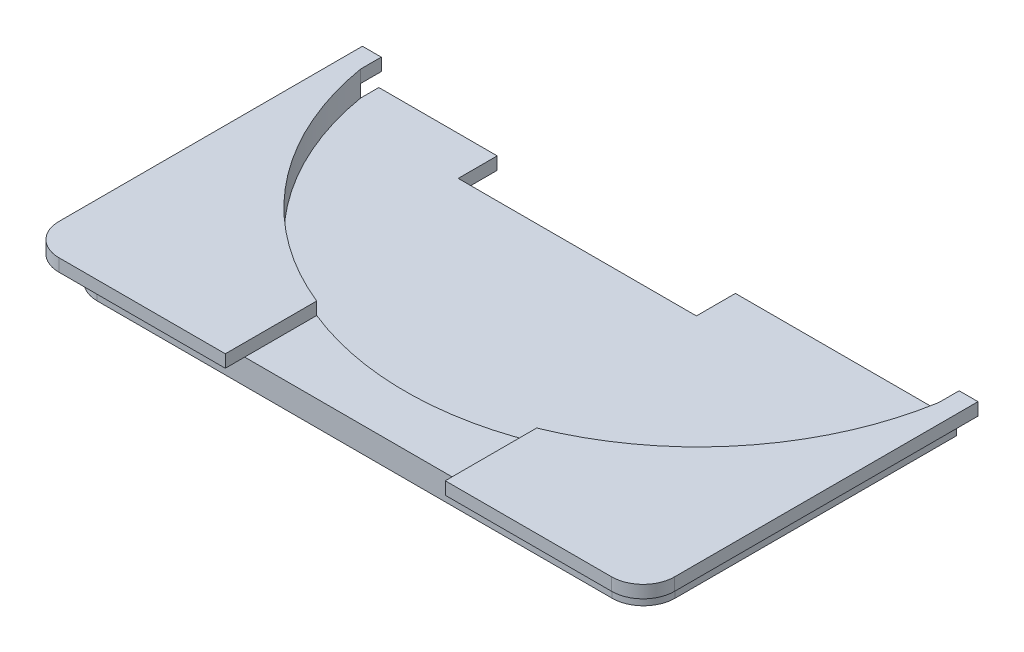
ISO-10303-21;
HEADER;
FILE_DESCRIPTION(('STEP AP214'),'2;1');
FILE_NAME('part.step','',(''),(''),'','','');
FILE_SCHEMA(('AUTOMOTIVE_DESIGN { 1 0 10303 214 1 1 1 1 }'));
ENDSEC;
DATA;
#1=APPLICATION_CONTEXT('core data for automotive mechanical design processes');
#2=APPLICATION_PROTOCOL_DEFINITION('international standard','automotive_design',2000,#1);
#3=PRODUCT_CONTEXT('',#1,'mechanical');
#4=PRODUCT('Part','Part','',(#3));
#5=PRODUCT_RELATED_PRODUCT_CATEGORY('part','',(#4));
#6=PRODUCT_DEFINITION_FORMATION('','',#4);
#7=PRODUCT_DEFINITION_CONTEXT('part definition',#1,'design');
#8=PRODUCT_DEFINITION('design','',#6,#7);
#9=PRODUCT_DEFINITION_SHAPE('','',#8);
#10=(LENGTH_UNIT() NAMED_UNIT(*) SI_UNIT(.MILLI.,.METRE.));
#11=(NAMED_UNIT(*) PLANE_ANGLE_UNIT() SI_UNIT($,.RADIAN.));
#12=(NAMED_UNIT(*) SI_UNIT($,.STERADIAN.) SOLID_ANGLE_UNIT());
#13=UNCERTAINTY_MEASURE_WITH_UNIT(LENGTH_MEASURE(1.E-05),#10,'distance_accuracy_value','');
#14=(GEOMETRIC_REPRESENTATION_CONTEXT(3) GLOBAL_UNCERTAINTY_ASSIGNED_CONTEXT((#13)) GLOBAL_UNIT_ASSIGNED_CONTEXT((#10,
#11,#12)) REPRESENTATION_CONTEXT('',''));
#15=CARTESIAN_POINT('',(0.,0.,0.));
#16=DIRECTION('',(0.,0.,1.));
#17=DIRECTION('',(1.,0.,0.));
#18=AXIS2_PLACEMENT_3D('',#15,#16,#17);
#19=CARTESIAN_POINT('',(-102.035735829472,4.,45.8580425502869));
#20=DIRECTION('',(0.,1.,0.));
#21=DIRECTION('',(0.,0.,1.));
#22=AXIS2_PLACEMENT_3D('',#19,#20,#21);
#23=PLANE('',#22);
#24=DIRECTION('',(1.,0.,0.));
#25=VECTOR('',#24,1.);
#26=CARTESIAN_POINT('',(-102.035735829472,4.,50.8580425502869));
#27=LINE('',#26,#25);
#28=CARTESIAN_POINT('',(-78.5477078121989,4.,50.8580425502869));
#29=VERTEX_POINT('',#28);
#30=CARTESIAN_POINT('',(-43.5307751661155,4.,50.8580425502869));
#31=VERTEX_POINT('',#30);
#32=EDGE_CURVE('E343',#29,#31,#27,.T.);
#33=ORIENTED_EDGE('',*,*,#32,.T.);
#34=DIRECTION('',(0.,0.,1.));
#35=VECTOR('',#34,1.);
#36=CARTESIAN_POINT('',(-43.5307751661155,4.,53.9393128759553));
#37=LINE('',#36,#35);
#38=CARTESIAN_POINT('',(-43.5307751661155,4.,39.3922849965716));
#39=VERTEX_POINT('',#38);
#40=EDGE_CURVE('E701',#39,#31,#37,.T.);
#41=ORIENTED_EDGE('',*,*,#40,.F.);
#42=CARTESIAN_POINT('',(-61.0392414891572,4.,-3.84195744971311));
#43=DIRECTION('',(0.,1.,0.));
#44=DIRECTION('',(0.,0.,1.));
#45=AXIS2_PLACEMENT_3D('',#42,#43,#44);
#46=CIRCLE('',#45,46.6448937493614);
#47=CARTESIAN_POINT('',(-78.5477078121989,4.,39.3922849965716));
#48=VERTEX_POINT('',#47);
#49=EDGE_CURVE('E319',#48,#39,#46,.T.);
#50=ORIENTED_EDGE('',*,*,#49,.F.);
#51=DIRECTION('',(0.,0.,-1.));
#52=VECTOR('',#51,1.);
#53=CARTESIAN_POINT('',(-78.5477078121989,4.,53.9393128759553));
#54=LINE('',#53,#52);
#55=EDGE_CURVE('E11',#29,#48,#54,.T.);
#56=ORIENTED_EDGE('',*,*,#55,.F.);
#57=EDGE_LOOP('',(#33,#41,#50,#56));
#58=FACE_BOUND('',#57,.T.);
#59=ADVANCED_FACE('F33',(#58),#23,.T.);
#60=CARTESIAN_POINT('',(-102.035735829472,0.,45.8580425502869));
#61=DIRECTION('',(0.,1.,0.));
#62=DIRECTION('',(0.,0.,1.));
#63=AXIS2_PLACEMENT_3D('',#60,#61,#62);
#64=PLANE('',#63);
#65=DIRECTION('',(0.,0.,1.));
#66=VECTOR('',#65,1.);
#67=CARTESIAN_POINT('',(-107.035735829472,0.,-49.1419574497131));
#68=LINE('',#67,#66);
#69=CARTESIAN_POINT('',(-107.035735829472,0.,1.01136300629423));
#70=VERTEX_POINT('',#69);
#71=CARTESIAN_POINT('',(-107.035735829472,0.,45.8580425502868));
#72=VERTEX_POINT('',#71);
#73=EDGE_CURVE('E335',#70,#72,#68,.T.);
#74=ORIENTED_EDGE('',*,*,#73,.F.);
#75=DIRECTION('',(1.,0.,0.));
#76=VECTOR('',#75,1.);
#77=CARTESIAN_POINT('',(-102.035735829472,0.,1.01136300629422));
#78=LINE('',#77,#76);
#79=CARTESIAN_POINT('',(-88.1898360293224,0.,1.01136300629423));
#80=VERTEX_POINT('',#79);
#81=EDGE_CURVE('E294',#70,#80,#78,.T.);
#82=ORIENTED_EDGE('',*,*,#81,.T.);
#83=DIRECTION('',(0.,0.,1.));
#84=VECTOR('',#83,1.);
#85=CARTESIAN_POINT('',(-88.1898360293224,0.,-14.7440043560306));
#86=LINE('',#85,#84);
#87=CARTESIAN_POINT('',(-88.1898360293224,0.,7.2220291908083));
#88=VERTEX_POINT('',#87);
#89=EDGE_CURVE('E303',#80,#88,#86,.T.);
#90=ORIENTED_EDGE('',*,*,#89,.T.);
#91=DIRECTION('',(1.,0.,0.));
#92=VECTOR('',#91,1.);
#93=CARTESIAN_POINT('',(-50.2680723261196,0.,7.2220291908083));
#94=LINE('',#93,#92);
#95=CARTESIAN_POINT('',(-50.2680723261196,0.,7.2220291908083));
#96=VERTEX_POINT('',#95);
#97=EDGE_CURVE('E306',#88,#96,#94,.T.);
#98=ORIENTED_EDGE('',*,*,#97,.T.);
#99=DIRECTION('',(0.,0.,-1.));
#100=VECTOR('',#99,1.);
#101=CARTESIAN_POINT('',(-50.2680723261196,0.,-14.7440043560306));
#102=LINE('',#101,#100);
#103=CARTESIAN_POINT('',(-50.2680723261196,0.,1.01136300629422));
#104=VERTEX_POINT('',#103);
#105=EDGE_CURVE('E300',#96,#104,#102,.T.);
#106=ORIENTED_EDGE('',*,*,#105,.T.);
#107=CARTESIAN_POINT('',(-15.0357358294719,0.,1.01136300629423));
#108=VERTEX_POINT('',#107);
#109=EDGE_CURVE('E56',#104,#108,#78,.T.);
#110=ORIENTED_EDGE('',*,*,#109,.T.);
#111=DIRECTION('',(0.,0.,-1.));
#112=VECTOR('',#111,1.);
#113=CARTESIAN_POINT('',(-15.0357358294719,0.,-49.1419574497131));
#114=LINE('',#113,#112);
#115=CARTESIAN_POINT('',(-15.0357358294719,0.,45.8580425502868));
#116=VERTEX_POINT('',#115);
#117=EDGE_CURVE('E340',#116,#108,#114,.T.);
#118=ORIENTED_EDGE('',*,*,#117,.F.);
#119=CARTESIAN_POINT('',(-20.0357358294719,0.,45.8580425502869));
#120=DIRECTION('',(0.,1.,0.));
#121=DIRECTION('',(0.,0.,1.));
#122=AXIS2_PLACEMENT_3D('',#119,#120,#121);
#123=CIRCLE('',#122,5.);
#124=CARTESIAN_POINT('',(-20.035735829472,0.,50.8580425502869));
#125=VERTEX_POINT('',#124);
#126=EDGE_CURVE('E358',#125,#116,#123,.T.);
#127=ORIENTED_EDGE('',*,*,#126,.F.);
#128=DIRECTION('',(1.,0.,0.));
#129=VECTOR('',#128,1.);
#130=CARTESIAN_POINT('',(-102.035735829472,0.,50.8580425502869));
#131=LINE('',#130,#129);
#132=CARTESIAN_POINT('',(-102.035735829472,0.,50.8580425502869));
#133=VERTEX_POINT('',#132);
#134=EDGE_CURVE('E356',#133,#125,#131,.T.);
#135=ORIENTED_EDGE('',*,*,#134,.F.);
#136=CARTESIAN_POINT('',(-102.035735829472,0.,45.8580425502869));
#137=DIRECTION('',(0.,1.,0.));
#138=DIRECTION('',(0.,0.,1.));
#139=AXIS2_PLACEMENT_3D('',#136,#137,#138);
#140=CIRCLE('',#139,5.);
#141=EDGE_CURVE('E354',#72,#133,#140,.T.);
#142=ORIENTED_EDGE('',*,*,#141,.F.);
#143=EDGE_LOOP('',(#74,#82,#90,#98,#106,#110,#118,#127,#135,#142));
#144=FACE_BOUND('',#143,.T.);
#145=ADVANCED_FACE('F397',(#144),#64,.F.);
#146=CARTESIAN_POINT('',(-107.035735829472,4.,-49.1419574497131));
#147=DIRECTION('',(1.,0.,0.));
#148=DIRECTION('',(0.,0.,-1.));
#149=AXIS2_PLACEMENT_3D('',#146,#147,#148);
#150=PLANE('',#149);
#151=DIRECTION('',(0.,0.,1.));
#152=VECTOR('',#151,1.);
#153=CARTESIAN_POINT('',(-107.035735829472,2.,-49.1419574497131));
#154=LINE('',#153,#152);
#155=CARTESIAN_POINT('',(-107.035735829472,2.,1.01136300629423));
#156=VERTEX_POINT('',#155);
#157=CARTESIAN_POINT('',(-107.035735829472,2.,3.90843746220009));
#158=VERTEX_POINT('',#157);
#159=EDGE_CURVE('E330',#156,#158,#154,.T.);
#160=ORIENTED_EDGE('',*,*,#159,.F.);
#161=DIRECTION('',(0.,1.,0.));
#162=VECTOR('',#161,1.);
#163=CARTESIAN_POINT('',(-107.035735829472,-8.,1.01136300629423));
#164=LINE('',#163,#162);
#165=EDGE_CURVE('E290',#70,#156,#164,.T.);
#166=ORIENTED_EDGE('',*,*,#165,.F.);
#167=ORIENTED_EDGE('',*,*,#73,.T.);
#168=DIRECTION('',(0.,-1.,0.));
#169=VECTOR('',#168,1.);
#170=CARTESIAN_POINT('',(-107.035735829472,4.,45.8580425502868));
#171=LINE('',#170,#169);
#172=CARTESIAN_POINT('',(-107.035735829472,4.,45.8580425502868));
#173=VERTEX_POINT('',#172);
#174=EDGE_CURVE('E370',#173,#72,#171,.T.);
#175=ORIENTED_EDGE('',*,*,#174,.F.);
#176=DIRECTION('',(0.,0.,1.));
#177=VECTOR('',#176,1.);
#178=CARTESIAN_POINT('',(-107.035735829472,4.,-49.1419574497131));
#179=LINE('',#178,#177);
#180=CARTESIAN_POINT('',(-107.035735829472,4.,3.90843746220009));
#181=VERTEX_POINT('',#180);
#182=EDGE_CURVE('E336',#181,#173,#179,.T.);
#183=ORIENTED_EDGE('',*,*,#182,.F.);
#184=DIRECTION('',(0.,1.,0.));
#185=VECTOR('',#184,1.);
#186=CARTESIAN_POINT('',(-107.035735829472,2.,3.90843746220009));
#187=LINE('',#186,#185);
#188=EDGE_CURVE('E332',#181,#158,#187,.F.);
#189=ORIENTED_EDGE('',*,*,#188,.T.);
#190=EDGE_LOOP('',(#160,#166,#167,#175,#183,#189));
#191=FACE_BOUND('',#190,.T.);
#192=ADVANCED_FACE('F35',(#191),#150,.F.);
#193=CARTESIAN_POINT('',(-102.035735829472,4.,45.8580425502869));
#194=DIRECTION('',(0.,-1.,0.));
#195=DIRECTION('',(0.,0.,-1.));
#196=AXIS2_PLACEMENT_3D('',#193,#194,#195);
#197=CYLINDRICAL_SURFACE('',#196,5.);
#198=ORIENTED_EDGE('',*,*,#141,.T.);
#199=DIRECTION('',(0.,-1.,0.));
#200=VECTOR('',#199,1.);
#201=CARTESIAN_POINT('',(-102.035735829472,4.,50.8580425502869));
#202=LINE('',#201,#200);
#203=CARTESIAN_POINT('',(-102.035735829472,4.,50.8580425502869));
#204=VERTEX_POINT('',#203);
#205=EDGE_CURVE('E367',#204,#133,#202,.T.);
#206=ORIENTED_EDGE('',*,*,#205,.F.);
#207=CARTESIAN_POINT('',(-102.035735829472,4.,45.8580425502869));
#208=DIRECTION('',(0.,1.,0.));
#209=DIRECTION('',(0.,0.,1.));
#210=AXIS2_PLACEMENT_3D('',#207,#208,#209);
#211=CIRCLE('',#210,5.);
#212=EDGE_CURVE('E339',#173,#204,#211,.T.);
#213=ORIENTED_EDGE('',*,*,#212,.F.);
#214=ORIENTED_EDGE('',*,*,#174,.T.);
#215=EDGE_LOOP('',(#198,#206,#213,#214));
#216=FACE_BOUND('',#215,.T.);
#217=ADVANCED_FACE('F428',(#216),#197,.T.);
#218=CARTESIAN_POINT('',(-102.035735829472,4.,50.8580425502869));
#219=DIRECTION('',(0.,0.,-1.));
#220=DIRECTION('',(-1.,0.,0.));
#221=AXIS2_PLACEMENT_3D('',#218,#219,#220);
#222=PLANE('',#221);
#223=ORIENTED_EDGE('',*,*,#134,.T.);
#224=DIRECTION('',(0.,-1.,0.));
#225=VECTOR('',#224,1.);
#226=CARTESIAN_POINT('',(-20.035735829472,4.,50.8580425502869));
#227=LINE('',#226,#225);
#228=CARTESIAN_POINT('',(-20.0357358294719,4.,50.8580425502869));
#229=VERTEX_POINT('',#228);
#230=EDGE_CURVE('E364',#229,#125,#227,.T.);
#231=ORIENTED_EDGE('',*,*,#230,.F.);
#232=DIRECTION('',(1.,0.,0.));
#233=VECTOR('',#232,1.);
#234=CARTESIAN_POINT('',(-102.035735829472,4.,50.8580425502869));
#235=LINE('',#234,#233);
#236=EDGE_CURVE('E232',#31,#229,#235,.T.);
#237=ORIENTED_EDGE('',*,*,#236,.F.);
#238=ORIENTED_EDGE('',*,*,#32,.F.);
#239=EDGE_CURVE('E344',#204,#29,#27,.T.);
#240=ORIENTED_EDGE('',*,*,#239,.F.);
#241=ORIENTED_EDGE('',*,*,#205,.T.);
#242=EDGE_LOOP('',(#223,#231,#237,#238,#240,#241));
#243=FACE_BOUND('',#242,.T.);
#244=ADVANCED_FACE('F425',(#243),#222,.F.);
#245=CARTESIAN_POINT('',(-20.0357358294719,4.,45.8580425502869));
#246=DIRECTION('',(0.,-1.,0.));
#247=DIRECTION('',(0.,0.,-1.));
#248=AXIS2_PLACEMENT_3D('',#245,#246,#247);
#249=CYLINDRICAL_SURFACE('',#248,5.);
#250=ORIENTED_EDGE('',*,*,#126,.T.);
#251=DIRECTION('',(0.,-1.,0.));
#252=VECTOR('',#251,1.);
#253=CARTESIAN_POINT('',(-15.0357358294719,4.,45.8580425502868));
#254=LINE('',#253,#252);
#255=CARTESIAN_POINT('',(-15.0357358294719,4.,45.8580425502869));
#256=VERTEX_POINT('',#255);
#257=EDGE_CURVE('E352',#256,#116,#254,.T.);
#258=ORIENTED_EDGE('',*,*,#257,.F.);
#259=CARTESIAN_POINT('',(-20.0357358294719,4.,45.8580425502869));
#260=DIRECTION('',(0.,1.,0.));
#261=DIRECTION('',(0.,0.,1.));
#262=AXIS2_PLACEMENT_3D('',#259,#260,#261);
#263=CIRCLE('',#262,5.);
#264=EDGE_CURVE('E347',#229,#256,#263,.T.);
#265=ORIENTED_EDGE('',*,*,#264,.F.);
#266=ORIENTED_EDGE('',*,*,#230,.T.);
#267=EDGE_LOOP('',(#250,#258,#265,#266));
#268=FACE_BOUND('',#267,.T.);
#269=ADVANCED_FACE('F421',(#268),#249,.T.);
#270=CARTESIAN_POINT('',(-15.0357358294719,4.,-49.1419574497131));
#271=DIRECTION('',(-1.,0.,0.));
#272=DIRECTION('',(0.,0.,1.));
#273=AXIS2_PLACEMENT_3D('',#270,#271,#272);
#274=PLANE('',#273);
#275=ORIENTED_EDGE('',*,*,#117,.T.);
#276=DIRECTION('',(0.,1.,0.));
#277=VECTOR('',#276,1.);
#278=CARTESIAN_POINT('',(-15.0357358294719,-8.,1.01136300629423));
#279=LINE('',#278,#277);
#280=CARTESIAN_POINT('',(-15.0357358294719,2.,1.01136300629423));
#281=VERTEX_POINT('',#280);
#282=EDGE_CURVE('E291',#108,#281,#279,.T.);
#283=ORIENTED_EDGE('',*,*,#282,.T.);
#284=DIRECTION('',(0.,0.,-1.));
#285=VECTOR('',#284,1.);
#286=CARTESIAN_POINT('',(-15.0357358294719,2.,-49.1419574497131));
#287=LINE('',#286,#285);
#288=CARTESIAN_POINT('',(-15.0357358294719,2.,3.86671169019128));
#289=VERTEX_POINT('',#288);
#290=EDGE_CURVE('E325',#289,#281,#287,.T.);
#291=ORIENTED_EDGE('',*,*,#290,.F.);
#292=DIRECTION('',(0.,1.,0.));
#293=VECTOR('',#292,1.);
#294=CARTESIAN_POINT('',(-15.0357358294719,2.,3.86671169019128));
#295=LINE('',#294,#293);
#296=CARTESIAN_POINT('',(-15.0357358294719,4.,3.86671169019128));
#297=VERTEX_POINT('',#296);
#298=EDGE_CURVE('E372',#289,#297,#295,.T.);
#299=ORIENTED_EDGE('',*,*,#298,.T.);
#300=DIRECTION('',(0.,0.,-1.));
#301=VECTOR('',#300,1.);
#302=CARTESIAN_POINT('',(-15.0357358294719,4.,-49.1419574497131));
#303=LINE('',#302,#301);
#304=EDGE_CURVE('E349',#256,#297,#303,.T.);
#305=ORIENTED_EDGE('',*,*,#304,.F.);
#306=ORIENTED_EDGE('',*,*,#257,.T.);
#307=EDGE_LOOP('',(#275,#283,#291,#299,#305,#306));
#308=FACE_BOUND('',#307,.T.);
#309=ADVANCED_FACE('F416',(#308),#274,.F.);
#310=CARTESIAN_POINT('',(-61.0392414891572,2.,-3.84195744971311));
#311=DIRECTION('',(0.,1.,0.));
#312=DIRECTION('',(0.,0.,1.));
#313=AXIS2_PLACEMENT_3D('',#310,#311,#312);
#314=CYLINDRICAL_SURFACE('',#313,46.6448937493614);
#315=ORIENTED_EDGE('',*,*,#188,.F.);
#316=DIRECTION('',(0.,-1.,0.));
#317=VECTOR('',#316,1.);
#318=CARTESIAN_POINT('',(-107.035735829472,6.,3.90843746220009));
#319=LINE('',#318,#317);
#320=CARTESIAN_POINT('',(-107.035735829472,6.,3.90843746220009));
#321=VERTEX_POINT('',#320);
#322=EDGE_CURVE('E272',#321,#181,#319,.T.);
#323=ORIENTED_EDGE('',*,*,#322,.F.);
#324=CARTESIAN_POINT('',(-61.0392414891572,6.,-3.84195744971312));
#325=DIRECTION('',(0.,-1.,0.));
#326=DIRECTION('',(0.,0.,1.));
#327=AXIS2_PLACEMENT_3D('',#324,#325,#326);
#328=CIRCLE('',#327,46.6448937493614);
#329=CARTESIAN_POINT('',(-78.5477078121989,6.,39.3922849965716));
#330=VERTEX_POINT('',#329);
#331=EDGE_CURVE('E250',#330,#321,#328,.T.);
#332=ORIENTED_EDGE('',*,*,#331,.F.);
#333=DIRECTION('',(0.,-1.,0.));
#334=VECTOR('',#333,1.);
#335=CARTESIAN_POINT('',(-78.5477078121989,6.,39.3922849965716));
#336=LINE('',#335,#334);
#337=EDGE_CURVE('E275',#330,#48,#336,.T.);
#338=ORIENTED_EDGE('',*,*,#337,.T.);
#339=ORIENTED_EDGE('',*,*,#49,.T.);
#340=DIRECTION('',(0.,-1.,0.));
#341=VECTOR('',#340,1.);
#342=CARTESIAN_POINT('',(-43.5307751661155,6.,39.3922849965716));
#343=LINE('',#342,#341);
#344=CARTESIAN_POINT('',(-43.5307751661155,6.,39.3922849965716));
#345=VERTEX_POINT('',#344);
#346=EDGE_CURVE('E236',#345,#39,#343,.T.);
#347=ORIENTED_EDGE('',*,*,#346,.F.);
#348=CARTESIAN_POINT('',(-61.0392414891572,6.,-3.84195744971312));
#349=DIRECTION('',(0.,-1.,0.));
#350=DIRECTION('',(0.,0.,1.));
#351=AXIS2_PLACEMENT_3D('',#348,#349,#350);
#352=CIRCLE('',#351,46.6448937493614);
#353=CARTESIAN_POINT('',(-15.0357358294719,6.,3.86671169019127));
#354=VERTEX_POINT('',#353);
#355=EDGE_CURVE('E217',#354,#345,#352,.T.);
#356=ORIENTED_EDGE('',*,*,#355,.F.);
#357=DIRECTION('',(0.,-1.,0.));
#358=VECTOR('',#357,1.);
#359=CARTESIAN_POINT('',(-15.0357358294719,6.,3.86671169019127));
#360=LINE('',#359,#358);
#361=EDGE_CURVE('E214',#354,#297,#360,.T.);
#362=ORIENTED_EDGE('',*,*,#361,.T.);
#363=ORIENTED_EDGE('',*,*,#298,.F.);
#364=CARTESIAN_POINT('',(-61.0392414891572,2.,-3.84195744971311));
#365=DIRECTION('',(0.,1.,0.));
#366=DIRECTION('',(0.,0.,1.));
#367=AXIS2_PLACEMENT_3D('',#364,#365,#366);
#368=CIRCLE('',#367,46.6448937493614);
#369=EDGE_CURVE('E322',#158,#289,#368,.T.);
#370=ORIENTED_EDGE('',*,*,#369,.F.);
#371=EDGE_LOOP('',(#315,#323,#332,#338,#339,#347,#356,#362,#363,#370));
#372=FACE_BOUND('',#371,.T.);
#373=ADVANCED_FACE('F406',(#372),#314,.F.);
#374=CARTESIAN_POINT('',(-61.0392414891572,2.,-3.84195744971311));
#375=DIRECTION('',(0.,1.,0.));
#376=DIRECTION('',(0.,0.,1.));
#377=AXIS2_PLACEMENT_3D('',#374,#375,#376);
#378=PLANE('',#377);
#379=DIRECTION('',(1.,0.,0.));
#380=VECTOR('',#379,1.);
#381=CARTESIAN_POINT('',(-107.035735829472,2.,1.01136300629423));
#382=LINE('',#381,#380);
#383=CARTESIAN_POINT('',(-88.1898360293224,2.,1.01136300629422));
#384=VERTEX_POINT('',#383);
#385=EDGE_CURVE('E288',#156,#384,#382,.T.);
#386=ORIENTED_EDGE('',*,*,#385,.F.);
#387=ORIENTED_EDGE('',*,*,#159,.T.);
#388=ORIENTED_EDGE('',*,*,#369,.T.);
#389=ORIENTED_EDGE('',*,*,#290,.T.);
#390=CARTESIAN_POINT('',(-50.2680723261196,2.,1.01136300629423));
#391=VERTEX_POINT('',#390);
#392=EDGE_CURVE('E287',#391,#281,#382,.T.);
#393=ORIENTED_EDGE('',*,*,#392,.F.);
#394=DIRECTION('',(0.,0.,-1.));
#395=VECTOR('',#394,1.);
#396=CARTESIAN_POINT('',(-50.2680723261196,2.,-14.7440043560306));
#397=LINE('',#396,#395);
#398=CARTESIAN_POINT('',(-50.2680723261196,2.,7.2220291908083));
#399=VERTEX_POINT('',#398);
#400=EDGE_CURVE('E310',#399,#391,#397,.T.);
#401=ORIENTED_EDGE('',*,*,#400,.F.);
#402=DIRECTION('',(1.,0.,0.));
#403=VECTOR('',#402,1.);
#404=CARTESIAN_POINT('',(-50.2680723261196,2.,7.2220291908083));
#405=LINE('',#404,#403);
#406=CARTESIAN_POINT('',(-88.1898360293224,2.,7.2220291908083));
#407=VERTEX_POINT('',#406);
#408=EDGE_CURVE('E304',#407,#399,#405,.T.);
#409=ORIENTED_EDGE('',*,*,#408,.F.);
#410=DIRECTION('',(0.,0.,1.));
#411=VECTOR('',#410,1.);
#412=CARTESIAN_POINT('',(-88.1898360293224,2.,-14.7440043560306));
#413=LINE('',#412,#411);
#414=EDGE_CURVE('E313',#384,#407,#413,.T.);
#415=ORIENTED_EDGE('',*,*,#414,.F.);
#416=EDGE_LOOP('',(#386,#387,#388,#389,#393,#401,#409,#415));
#417=FACE_BOUND('',#416,.T.);
#418=ADVANCED_FACE('F387',(#417),#378,.T.);
#419=CARTESIAN_POINT('',(-50.2680723261196,0.,-14.7440043560306));
#420=DIRECTION('',(1.,0.,0.));
#421=DIRECTION('',(0.,0.,-1.));
#422=AXIS2_PLACEMENT_3D('',#419,#420,#421);
#423=PLANE('',#422);
#424=ORIENTED_EDGE('',*,*,#400,.T.);
#425=DIRECTION('',(0.,-1.,0.));
#426=VECTOR('',#425,1.);
#427=CARTESIAN_POINT('',(-50.2680723261196,0.,1.01136300629423));
#428=LINE('',#427,#426);
#429=EDGE_CURVE('E298',#391,#104,#428,.T.);
#430=ORIENTED_EDGE('',*,*,#429,.T.);
#431=ORIENTED_EDGE('',*,*,#105,.F.);
#432=DIRECTION('',(0.,1.,0.));
#433=VECTOR('',#432,1.);
#434=CARTESIAN_POINT('',(-50.2680723261196,0.,7.2220291908083));
#435=LINE('',#434,#433);
#436=EDGE_CURVE('E317',#96,#399,#435,.T.);
#437=ORIENTED_EDGE('',*,*,#436,.T.);
#438=EDGE_LOOP('',(#424,#430,#431,#437));
#439=FACE_BOUND('',#438,.T.);
#440=ADVANCED_FACE('F511',(#439),#423,.F.);
#441=CARTESIAN_POINT('',(-50.2680723261196,0.,7.2220291908083));
#442=DIRECTION('',(0.,0.,1.));
#443=DIRECTION('',(1.,0.,0.));
#444=AXIS2_PLACEMENT_3D('',#441,#442,#443);
#445=PLANE('',#444);
#446=ORIENTED_EDGE('',*,*,#408,.T.);
#447=ORIENTED_EDGE('',*,*,#436,.F.);
#448=ORIENTED_EDGE('',*,*,#97,.F.);
#449=DIRECTION('',(0.,1.,0.));
#450=VECTOR('',#449,1.);
#451=CARTESIAN_POINT('',(-88.1898360293224,0.,7.2220291908083));
#452=LINE('',#451,#450);
#453=EDGE_CURVE('E309',#88,#407,#452,.T.);
#454=ORIENTED_EDGE('',*,*,#453,.T.);
#455=EDGE_LOOP('',(#446,#447,#448,#454));
#456=FACE_BOUND('',#455,.T.);
#457=ADVANCED_FACE('F392',(#456),#445,.F.);
#458=CARTESIAN_POINT('',(-88.1898360293224,0.,-14.7440043560306));
#459=DIRECTION('',(-1.,0.,0.));
#460=DIRECTION('',(0.,0.,1.));
#461=AXIS2_PLACEMENT_3D('',#458,#459,#460);
#462=PLANE('',#461);
#463=ORIENTED_EDGE('',*,*,#89,.F.);
#464=DIRECTION('',(0.,1.,0.));
#465=VECTOR('',#464,1.);
#466=CARTESIAN_POINT('',(-88.1898360293224,0.,1.01136300629423));
#467=LINE('',#466,#465);
#468=EDGE_CURVE('E37',#80,#384,#467,.T.);
#469=ORIENTED_EDGE('',*,*,#468,.T.);
#470=ORIENTED_EDGE('',*,*,#414,.T.);
#471=ORIENTED_EDGE('',*,*,#453,.F.);
#472=EDGE_LOOP('',(#463,#469,#470,#471));
#473=FACE_BOUND('',#472,.T.);
#474=ADVANCED_FACE('F381',(#473),#462,.F.);
#475=CARTESIAN_POINT('',(-107.035735829472,-8.,1.01136300629423));
#476=DIRECTION('',(0.,0.,1.));
#477=DIRECTION('',(1.,0.,0.));
#478=AXIS2_PLACEMENT_3D('',#475,#476,#477);
#479=PLANE('',#478);
#480=ORIENTED_EDGE('',*,*,#165,.T.);
#481=ORIENTED_EDGE('',*,*,#385,.T.);
#482=ORIENTED_EDGE('',*,*,#468,.F.);
#483=ORIENTED_EDGE('',*,*,#81,.F.);
#484=EDGE_LOOP('',(#480,#481,#482,#483));
#485=FACE_BOUND('',#484,.T.);
#486=ADVANCED_FACE('F400',(#485),#479,.F.);
#487=ORIENTED_EDGE('',*,*,#429,.F.);
#488=ORIENTED_EDGE('',*,*,#392,.T.);
#489=ORIENTED_EDGE('',*,*,#282,.F.);
#490=ORIENTED_EDGE('',*,*,#109,.F.);
#491=EDGE_LOOP('',(#487,#488,#489,#490));
#492=FACE_BOUND('',#491,.T.);
#493=ADVANCED_FACE('F469',(#492),#479,.F.);
#494=CARTESIAN_POINT('',(-105.035735829472,4.,48.9393128759553));
#495=DIRECTION('',(0.,1.,0.));
#496=DIRECTION('',(0.,0.,1.));
#497=AXIS2_PLACEMENT_3D('',#494,#495,#496);
#498=PLANE('',#497);
#499=DIRECTION('',(0.,0.,-1.));
#500=VECTOR('',#499,1.);
#501=CARTESIAN_POINT('',(-107.035735829472,4.,3.90843746220009));
#502=LINE('',#501,#500);
#503=CARTESIAN_POINT('',(-107.035735829472,4.,0.626443870858271));
#504=VERTEX_POINT('',#503);
#505=EDGE_CURVE('E264',#181,#504,#502,.T.);
#506=ORIENTED_EDGE('',*,*,#505,.F.);
#507=ORIENTED_EDGE('',*,*,#182,.T.);
#508=ORIENTED_EDGE('',*,*,#212,.T.);
#509=ORIENTED_EDGE('',*,*,#239,.T.);
#510=CARTESIAN_POINT('',(-78.5477078121989,4.,53.9393128759553));
#511=VERTEX_POINT('',#510);
#512=EDGE_CURVE('E43',#511,#29,#54,.T.);
#513=ORIENTED_EDGE('',*,*,#512,.F.);
#514=DIRECTION('',(1.,0.,0.));
#515=VECTOR('',#514,1.);
#516=CARTESIAN_POINT('',(-105.035735829472,4.,53.9393128759553));
#517=LINE('',#516,#515);
#518=CARTESIAN_POINT('',(-105.035735829472,4.,53.9393128759553));
#519=VERTEX_POINT('',#518);
#520=EDGE_CURVE('E261',#519,#511,#517,.T.);
#521=ORIENTED_EDGE('',*,*,#520,.F.);
#522=CARTESIAN_POINT('',(-105.035735829472,4.,48.9393128759553));
#523=DIRECTION('',(0.,1.,0.));
#524=DIRECTION('',(0.,0.,1.));
#525=AXIS2_PLACEMENT_3D('',#522,#523,#524);
#526=CIRCLE('',#525,5.);
#527=CARTESIAN_POINT('',(-110.035735829472,4.,48.9393128759553));
#528=VERTEX_POINT('',#527);
#529=EDGE_CURVE('E259',#528,#519,#526,.T.);
#530=ORIENTED_EDGE('',*,*,#529,.F.);
#531=DIRECTION('',(0.,0.,1.));
#532=VECTOR('',#531,1.);
#533=CARTESIAN_POINT('',(-110.035735829472,4.,0.626443870858271));
#534=LINE('',#533,#532);
#535=CARTESIAN_POINT('',(-110.035735829472,4.,0.626443870858271));
#536=VERTEX_POINT('',#535);
#537=EDGE_CURVE('E234',#536,#528,#534,.T.);
#538=ORIENTED_EDGE('',*,*,#537,.F.);
#539=DIRECTION('',(-1.,0.,0.));
#540=VECTOR('',#539,1.);
#541=CARTESIAN_POINT('',(-110.035735829472,4.,0.626443870858271));
#542=LINE('',#541,#540);
#543=EDGE_CURVE('E244',#504,#536,#542,.T.);
#544=ORIENTED_EDGE('',*,*,#543,.F.);
#545=EDGE_LOOP('',(#506,#507,#508,#509,#513,#521,#530,#538,#544));
#546=FACE_BOUND('',#545,.T.);
#547=ADVANCED_FACE('F431',(#546),#498,.F.);
#548=CARTESIAN_POINT('',(-110.035735829472,6.,0.626443870858271));
#549=DIRECTION('',(1.,0.,0.));
#550=DIRECTION('',(0.,0.,-1.));
#551=AXIS2_PLACEMENT_3D('',#548,#549,#550);
#552=PLANE('',#551);
#553=ORIENTED_EDGE('',*,*,#537,.T.);
#554=DIRECTION('',(0.,-1.,0.));
#555=VECTOR('',#554,1.);
#556=CARTESIAN_POINT('',(-110.035735829472,6.,48.9393128759553));
#557=LINE('',#556,#555);
#558=CARTESIAN_POINT('',(-110.035735829472,6.,48.9393128759553));
#559=VERTEX_POINT('',#558);
#560=EDGE_CURVE('E284',#559,#528,#557,.T.);
#561=ORIENTED_EDGE('',*,*,#560,.F.);
#562=DIRECTION('',(0.,0.,1.));
#563=VECTOR('',#562,1.);
#564=CARTESIAN_POINT('',(-110.035735829472,6.,0.626443870858271));
#565=LINE('',#564,#563);
#566=CARTESIAN_POINT('',(-110.035735829472,6.,0.626443870858271));
#567=VERTEX_POINT('',#566);
#568=EDGE_CURVE('E240',#567,#559,#565,.T.);
#569=ORIENTED_EDGE('',*,*,#568,.F.);
#570=DIRECTION('',(0.,-1.,0.));
#571=VECTOR('',#570,1.);
#572=CARTESIAN_POINT('',(-110.035735829472,6.,0.626443870858271));
#573=LINE('',#572,#571);
#574=EDGE_CURVE('E256',#567,#536,#573,.T.);
#575=ORIENTED_EDGE('',*,*,#574,.T.);
#576=EDGE_LOOP('',(#553,#561,#569,#575));
#577=FACE_BOUND('',#576,.T.);
#578=ADVANCED_FACE('F461',(#577),#552,.F.);
#579=CARTESIAN_POINT('',(-105.035735829472,6.,48.9393128759553));
#580=DIRECTION('',(0.,-1.,0.));
#581=DIRECTION('',(0.,0.,-1.));
#582=AXIS2_PLACEMENT_3D('',#579,#580,#581);
#583=CYLINDRICAL_SURFACE('',#582,5.);
#584=ORIENTED_EDGE('',*,*,#529,.T.);
#585=DIRECTION('',(0.,-1.,0.));
#586=VECTOR('',#585,1.);
#587=CARTESIAN_POINT('',(-105.035735829472,6.,53.9393128759553));
#588=LINE('',#587,#586);
#589=CARTESIAN_POINT('',(-105.035735829472,6.,53.9393128759553));
#590=VERTEX_POINT('',#589);
#591=EDGE_CURVE('E281',#590,#519,#588,.T.);
#592=ORIENTED_EDGE('',*,*,#591,.F.);
#593=CARTESIAN_POINT('',(-105.035735829472,6.,48.9393128759553));
#594=DIRECTION('',(0.,1.,0.));
#595=DIRECTION('',(0.,0.,1.));
#596=AXIS2_PLACEMENT_3D('',#593,#594,#595);
#597=CIRCLE('',#596,5.);
#598=EDGE_CURVE('E243',#559,#590,#597,.T.);
#599=ORIENTED_EDGE('',*,*,#598,.F.);
#600=ORIENTED_EDGE('',*,*,#560,.T.);
#601=EDGE_LOOP('',(#584,#592,#599,#600));
#602=FACE_BOUND('',#601,.T.);
#603=ADVANCED_FACE('F459',(#602),#583,.T.);
#604=CARTESIAN_POINT('',(-105.035735829472,6.,53.9393128759553));
#605=DIRECTION('',(0.,0.,-1.));
#606=DIRECTION('',(-1.,0.,0.));
#607=AXIS2_PLACEMENT_3D('',#604,#605,#606);
#608=PLANE('',#607);
#609=ORIENTED_EDGE('',*,*,#520,.T.);
#610=DIRECTION('',(0.,-1.,0.));
#611=VECTOR('',#610,1.);
#612=CARTESIAN_POINT('',(-78.5477078121989,6.,53.9393128759553));
#613=LINE('',#612,#611);
#614=CARTESIAN_POINT('',(-78.5477078121989,6.,53.9393128759553));
#615=VERTEX_POINT('',#614);
#616=EDGE_CURVE('E278',#615,#511,#613,.T.);
#617=ORIENTED_EDGE('',*,*,#616,.F.);
#618=DIRECTION('',(1.,0.,0.));
#619=VECTOR('',#618,1.);
#620=CARTESIAN_POINT('',(-105.035735829472,6.,53.9393128759553));
#621=LINE('',#620,#619);
#622=EDGE_CURVE('E246',#590,#615,#621,.T.);
#623=ORIENTED_EDGE('',*,*,#622,.F.);
#624=ORIENTED_EDGE('',*,*,#591,.T.);
#625=EDGE_LOOP('',(#609,#617,#623,#624));
#626=FACE_BOUND('',#625,.T.);
#627=ADVANCED_FACE('F455',(#626),#608,.F.);
#628=CARTESIAN_POINT('',(-78.5477078121989,6.,53.9393128759553));
#629=DIRECTION('',(-1.,0.,0.));
#630=DIRECTION('',(0.,0.,1.));
#631=AXIS2_PLACEMENT_3D('',#628,#629,#630);
#632=PLANE('',#631);
#633=ORIENTED_EDGE('',*,*,#512,.T.);
#634=ORIENTED_EDGE('',*,*,#55,.T.);
#635=ORIENTED_EDGE('',*,*,#337,.F.);
#636=DIRECTION('',(0.,0.,-1.));
#637=VECTOR('',#636,1.);
#638=CARTESIAN_POINT('',(-78.5477078121989,6.,53.9393128759553));
#639=LINE('',#638,#637);
#640=EDGE_CURVE('E248',#615,#330,#639,.T.);
#641=ORIENTED_EDGE('',*,*,#640,.F.);
#642=ORIENTED_EDGE('',*,*,#616,.T.);
#643=EDGE_LOOP('',(#633,#634,#635,#641,#642));
#644=FACE_BOUND('',#643,.T.);
#645=ADVANCED_FACE('F450',(#644),#632,.F.);
#646=CARTESIAN_POINT('',(-107.035735829472,6.,3.90843746220009));
#647=DIRECTION('',(-1.,0.,0.));
#648=DIRECTION('',(0.,0.,1.));
#649=AXIS2_PLACEMENT_3D('',#646,#647,#648);
#650=PLANE('',#649);
#651=ORIENTED_EDGE('',*,*,#505,.T.);
#652=DIRECTION('',(0.,-1.,0.));
#653=VECTOR('',#652,1.);
#654=CARTESIAN_POINT('',(-107.035735829472,6.,0.626443870858271));
#655=LINE('',#654,#653);
#656=CARTESIAN_POINT('',(-107.035735829472,6.,0.626443870858271));
#657=VERTEX_POINT('',#656);
#658=EDGE_CURVE('E269',#657,#504,#655,.T.);
#659=ORIENTED_EDGE('',*,*,#658,.F.);
#660=DIRECTION('',(0.,0.,-1.));
#661=VECTOR('',#660,1.);
#662=CARTESIAN_POINT('',(-107.035735829472,6.,3.90843746220009));
#663=LINE('',#662,#661);
#664=EDGE_CURVE('E252',#321,#657,#663,.T.);
#665=ORIENTED_EDGE('',*,*,#664,.F.);
#666=ORIENTED_EDGE('',*,*,#322,.T.);
#667=EDGE_LOOP('',(#651,#659,#665,#666));
#668=FACE_BOUND('',#667,.T.);
#669=ADVANCED_FACE('F436',(#668),#650,.F.);
#670=CARTESIAN_POINT('',(-110.035735829472,6.,0.626443870858271));
#671=DIRECTION('',(0.,0.,1.));
#672=DIRECTION('',(1.,0.,0.));
#673=AXIS2_PLACEMENT_3D('',#670,#671,#672);
#674=PLANE('',#673);
#675=ORIENTED_EDGE('',*,*,#543,.T.);
#676=ORIENTED_EDGE('',*,*,#574,.F.);
#677=DIRECTION('',(-1.,0.,0.));
#678=VECTOR('',#677,1.);
#679=CARTESIAN_POINT('',(-110.035735829472,6.,0.626443870858271));
#680=LINE('',#679,#678);
#681=EDGE_CURVE('E254',#657,#567,#680,.T.);
#682=ORIENTED_EDGE('',*,*,#681,.F.);
#683=ORIENTED_EDGE('',*,*,#658,.T.);
#684=EDGE_LOOP('',(#675,#676,#682,#683));
#685=FACE_BOUND('',#684,.T.);
#686=ADVANCED_FACE('F440',(#685),#674,.F.);
#687=CARTESIAN_POINT('',(-105.035735829472,6.,48.9393128759553));
#688=DIRECTION('',(0.,1.,0.));
#689=DIRECTION('',(0.,0.,1.));
#690=AXIS2_PLACEMENT_3D('',#687,#688,#689);
#691=PLANE('',#690);
#692=ORIENTED_EDGE('',*,*,#568,.T.);
#693=ORIENTED_EDGE('',*,*,#598,.T.);
#694=ORIENTED_EDGE('',*,*,#622,.T.);
#695=ORIENTED_EDGE('',*,*,#640,.T.);
#696=ORIENTED_EDGE('',*,*,#331,.T.);
#697=ORIENTED_EDGE('',*,*,#664,.T.);
#698=ORIENTED_EDGE('',*,*,#681,.T.);
#699=EDGE_LOOP('',(#692,#693,#694,#695,#696,#697,#698));
#700=FACE_BOUND('',#699,.T.);
#701=ADVANCED_FACE('F444',(#700),#691,.T.);
#702=CARTESIAN_POINT('',(-17.035735829472,4.,48.9393128759553));
#703=DIRECTION('',(0.,1.,0.));
#704=DIRECTION('',(0.,0.,1.));
#705=AXIS2_PLACEMENT_3D('',#702,#703,#704);
#706=PLANE('',#705);
#707=CARTESIAN_POINT('',(-43.5307751661155,4.,53.9393128759553));
#708=VERTEX_POINT('',#707);
#709=EDGE_CURVE('E411',#31,#708,#37,.T.);
#710=ORIENTED_EDGE('',*,*,#709,.F.);
#711=ORIENTED_EDGE('',*,*,#236,.T.);
#712=ORIENTED_EDGE('',*,*,#264,.T.);
#713=ORIENTED_EDGE('',*,*,#304,.T.);
#714=DIRECTION('',(0.,0.,1.));
#715=VECTOR('',#714,1.);
#716=CARTESIAN_POINT('',(-15.0357358294719,4.,3.86671169019128));
#717=LINE('',#716,#715);
#718=CARTESIAN_POINT('',(-15.0357358294719,4.,0.626443870858271));
#719=VERTEX_POINT('',#718);
#720=EDGE_CURVE('E409',#719,#297,#717,.T.);
#721=ORIENTED_EDGE('',*,*,#720,.F.);
#722=DIRECTION('',(-1.,0.,0.));
#723=VECTOR('',#722,1.);
#724=CARTESIAN_POINT('',(-15.0357358294719,4.,0.626443870858271));
#725=LINE('',#724,#723);
#726=CARTESIAN_POINT('',(-12.035735829472,4.,0.626443870858271));
#727=VERTEX_POINT('',#726);
#728=EDGE_CURVE('E231',#727,#719,#725,.T.);
#729=ORIENTED_EDGE('',*,*,#728,.F.);
#730=DIRECTION('',(0.,0.,-1.));
#731=VECTOR('',#730,1.);
#732=CARTESIAN_POINT('',(-12.035735829472,4.,0.626443870858271));
#733=LINE('',#732,#731);
#734=CARTESIAN_POINT('',(-12.035735829472,4.,48.9393128759553));
#735=VERTEX_POINT('',#734);
#736=EDGE_CURVE('E227',#735,#727,#733,.T.);
#737=ORIENTED_EDGE('',*,*,#736,.F.);
#738=CARTESIAN_POINT('',(-17.035735829472,4.,48.9393128759553));
#739=DIRECTION('',(0.,1.,0.));
#740=DIRECTION('',(0.,0.,1.));
#741=AXIS2_PLACEMENT_3D('',#738,#739,#740);
#742=CIRCLE('',#741,5.);
#743=CARTESIAN_POINT('',(-17.035735829472,4.,53.9393128759553));
#744=VERTEX_POINT('',#743);
#745=EDGE_CURVE('E694',#744,#735,#742,.T.);
#746=ORIENTED_EDGE('',*,*,#745,.F.);
#747=DIRECTION('',(1.,0.,0.));
#748=VECTOR('',#747,1.);
#749=CARTESIAN_POINT('',(-43.5307751661155,4.,53.9393128759553));
#750=LINE('',#749,#748);
#751=EDGE_CURVE('E704',#708,#744,#750,.T.);
#752=ORIENTED_EDGE('',*,*,#751,.F.);
#753=EDGE_LOOP('',(#710,#711,#712,#713,#721,#729,#737,#746,#752));
#754=FACE_BOUND('',#753,.T.);
#755=ADVANCED_FACE('F413',(#754),#706,.F.);
#756=CARTESIAN_POINT('',(-15.0357358294719,6.,0.626443870858271));
#757=DIRECTION('',(0.,0.,1.));
#758=DIRECTION('',(1.,0.,0.));
#759=AXIS2_PLACEMENT_3D('',#756,#757,#758);
#760=PLANE('',#759);
#761=ORIENTED_EDGE('',*,*,#728,.T.);
#762=DIRECTION('',(0.,-1.,0.));
#763=VECTOR('',#762,1.);
#764=CARTESIAN_POINT('',(-15.0357358294719,6.,0.626443870858271));
#765=LINE('',#764,#763);
#766=CARTESIAN_POINT('',(-15.0357358294719,6.,0.626443870858271));
#767=VERTEX_POINT('',#766);
#768=EDGE_CURVE('E212',#767,#719,#765,.T.);
#769=ORIENTED_EDGE('',*,*,#768,.F.);
#770=DIRECTION('',(-1.,0.,0.));
#771=VECTOR('',#770,1.);
#772=CARTESIAN_POINT('',(-15.0357358294719,6.,0.626443870858271));
#773=LINE('',#772,#771);
#774=CARTESIAN_POINT('',(-12.035735829472,6.,0.626443870858271));
#775=VERTEX_POINT('',#774);
#776=EDGE_CURVE('E218',#775,#767,#773,.T.);
#777=ORIENTED_EDGE('',*,*,#776,.F.);
#778=DIRECTION('',(0.,-1.,0.));
#779=VECTOR('',#778,1.);
#780=CARTESIAN_POINT('',(-12.035735829472,6.,0.626443870858271));
#781=LINE('',#780,#779);
#782=EDGE_CURVE('E690',#775,#727,#781,.T.);
#783=ORIENTED_EDGE('',*,*,#782,.T.);
#784=EDGE_LOOP('',(#761,#769,#777,#783));
#785=FACE_BOUND('',#784,.T.);
#786=ADVANCED_FACE('F229',(#785),#760,.F.);
#787=CARTESIAN_POINT('',(-15.0357358294719,6.,3.86671169019128));
#788=DIRECTION('',(1.,0.,0.));
#789=DIRECTION('',(0.,0.,-1.));
#790=AXIS2_PLACEMENT_3D('',#787,#788,#789);
#791=PLANE('',#790);
#792=ORIENTED_EDGE('',*,*,#720,.T.);
#793=ORIENTED_EDGE('',*,*,#361,.F.);
#794=DIRECTION('',(0.,0.,1.));
#795=VECTOR('',#794,1.);
#796=CARTESIAN_POINT('',(-15.0357358294719,6.,3.86671169019128));
#797=LINE('',#796,#795);
#798=EDGE_CURVE('E207',#767,#354,#797,.T.);
#799=ORIENTED_EDGE('',*,*,#798,.F.);
#800=ORIENTED_EDGE('',*,*,#768,.T.);
#801=EDGE_LOOP('',(#792,#793,#799,#800));
#802=FACE_BOUND('',#801,.T.);
#803=ADVANCED_FACE('F210',(#802),#791,.F.);
#804=CARTESIAN_POINT('',(-43.5307751661155,6.,53.9393128759553));
#805=DIRECTION('',(1.,0.,0.));
#806=DIRECTION('',(0.,0.,-1.));
#807=AXIS2_PLACEMENT_3D('',#804,#805,#806);
#808=PLANE('',#807);
#809=ORIENTED_EDGE('',*,*,#40,.T.);
#810=ORIENTED_EDGE('',*,*,#709,.T.);
#811=DIRECTION('',(0.,-1.,0.));
#812=VECTOR('',#811,1.);
#813=CARTESIAN_POINT('',(-43.5307751661155,6.,53.9393128759553));
#814=LINE('',#813,#812);
#815=CARTESIAN_POINT('',(-43.5307751661155,6.,53.9393128759553));
#816=VERTEX_POINT('',#815);
#817=EDGE_CURVE('E711',#816,#708,#814,.T.);
#818=ORIENTED_EDGE('',*,*,#817,.F.);
#819=DIRECTION('',(0.,0.,1.));
#820=VECTOR('',#819,1.);
#821=CARTESIAN_POINT('',(-43.5307751661155,6.,53.9393128759553));
#822=LINE('',#821,#820);
#823=EDGE_CURVE('E716',#345,#816,#822,.T.);
#824=ORIENTED_EDGE('',*,*,#823,.F.);
#825=ORIENTED_EDGE('',*,*,#346,.T.);
#826=EDGE_LOOP('',(#809,#810,#818,#824,#825));
#827=FACE_BOUND('',#826,.T.);
#828=ADVANCED_FACE('F630',(#827),#808,.F.);
#829=CARTESIAN_POINT('',(-43.5307751661155,6.,53.9393128759553));
#830=DIRECTION('',(0.,0.,-1.));
#831=DIRECTION('',(-1.,0.,0.));
#832=AXIS2_PLACEMENT_3D('',#829,#830,#831);
#833=PLANE('',#832);
#834=ORIENTED_EDGE('',*,*,#751,.T.);
#835=DIRECTION('',(0.,-1.,0.));
#836=VECTOR('',#835,1.);
#837=CARTESIAN_POINT('',(-17.035735829472,6.,53.9393128759553));
#838=LINE('',#837,#836);
#839=CARTESIAN_POINT('',(-17.035735829472,6.,53.9393128759553));
#840=VERTEX_POINT('',#839);
#841=EDGE_CURVE('E708',#840,#744,#838,.T.);
#842=ORIENTED_EDGE('',*,*,#841,.F.);
#843=DIRECTION('',(1.,0.,0.));
#844=VECTOR('',#843,1.);
#845=CARTESIAN_POINT('',(-43.5307751661155,6.,53.9393128759553));
#846=LINE('',#845,#844);
#847=EDGE_CURVE('E718',#816,#840,#846,.T.);
#848=ORIENTED_EDGE('',*,*,#847,.F.);
#849=ORIENTED_EDGE('',*,*,#817,.T.);
#850=EDGE_LOOP('',(#834,#842,#848,#849));
#851=FACE_BOUND('',#850,.T.);
#852=ADVANCED_FACE('F638',(#851),#833,.F.);
#853=CARTESIAN_POINT('',(-17.035735829472,6.,48.9393128759553));
#854=DIRECTION('',(0.,-1.,0.));
#855=DIRECTION('',(0.,0.,-1.));
#856=AXIS2_PLACEMENT_3D('',#853,#854,#855);
#857=CYLINDRICAL_SURFACE('',#856,5.);
#858=ORIENTED_EDGE('',*,*,#745,.T.);
#859=DIRECTION('',(0.,-1.,0.));
#860=VECTOR('',#859,1.);
#861=CARTESIAN_POINT('',(-12.035735829472,6.,48.9393128759553));
#862=LINE('',#861,#860);
#863=CARTESIAN_POINT('',(-12.035735829472,6.,48.9393128759553));
#864=VERTEX_POINT('',#863);
#865=EDGE_CURVE('E692',#864,#735,#862,.T.);
#866=ORIENTED_EDGE('',*,*,#865,.F.);
#867=CARTESIAN_POINT('',(-17.035735829472,6.,48.9393128759553));
#868=DIRECTION('',(0.,1.,0.));
#869=DIRECTION('',(0.,0.,1.));
#870=AXIS2_PLACEMENT_3D('',#867,#868,#869);
#871=CIRCLE('',#870,5.);
#872=EDGE_CURVE('E720',#840,#864,#871,.T.);
#873=ORIENTED_EDGE('',*,*,#872,.F.);
#874=ORIENTED_EDGE('',*,*,#841,.T.);
#875=EDGE_LOOP('',(#858,#866,#873,#874));
#876=FACE_BOUND('',#875,.T.);
#877=ADVANCED_FACE('F647',(#876),#857,.T.);
#878=CARTESIAN_POINT('',(-12.035735829472,6.,0.626443870858271));
#879=DIRECTION('',(-1.,0.,0.));
#880=DIRECTION('',(0.,0.,1.));
#881=AXIS2_PLACEMENT_3D('',#878,#879,#880);
#882=PLANE('',#881);
#883=ORIENTED_EDGE('',*,*,#736,.T.);
#884=ORIENTED_EDGE('',*,*,#782,.F.);
#885=DIRECTION('',(0.,0.,-1.));
#886=VECTOR('',#885,1.);
#887=CARTESIAN_POINT('',(-12.035735829472,6.,0.626443870858271));
#888=LINE('',#887,#886);
#889=EDGE_CURVE('E223',#864,#775,#888,.T.);
#890=ORIENTED_EDGE('',*,*,#889,.F.);
#891=ORIENTED_EDGE('',*,*,#865,.T.);
#892=EDGE_LOOP('',(#883,#884,#890,#891));
#893=FACE_BOUND('',#892,.T.);
#894=ADVANCED_FACE('F656',(#893),#882,.F.);
#895=CARTESIAN_POINT('',(-17.035735829472,6.,48.9393128759553));
#896=DIRECTION('',(0.,1.,0.));
#897=DIRECTION('',(0.,0.,1.));
#898=AXIS2_PLACEMENT_3D('',#895,#896,#897);
#899=PLANE('',#898);
#900=ORIENTED_EDGE('',*,*,#776,.T.);
#901=ORIENTED_EDGE('',*,*,#798,.T.);
#902=ORIENTED_EDGE('',*,*,#355,.T.);
#903=ORIENTED_EDGE('',*,*,#823,.T.);
#904=ORIENTED_EDGE('',*,*,#847,.T.);
#905=ORIENTED_EDGE('',*,*,#872,.T.);
#906=ORIENTED_EDGE('',*,*,#889,.T.);
#907=EDGE_LOOP('',(#900,#901,#902,#903,#904,#905,#906));
#908=FACE_BOUND('',#907,.T.);
#909=ADVANCED_FACE('F221',(#908),#899,.T.);
#910=CLOSED_SHELL('',(#59,#145,#192,#217,#244,#269,#309,#373,#418,#440,#457,#474,#486,#493,#547,
#578,#603,#627,#645,#669,#686,#701,#755,#786,#803,#828,#852,#877,#894,#909));
#911=MANIFOLD_SOLID_BREP('B2',#910);
#912=ADVANCED_BREP_SHAPE_REPRESENTATION('',(#18,#911),#14);
#913=SHAPE_DEFINITION_REPRESENTATION(#9,#912);
ENDSEC;
END-ISO-10303-21;
